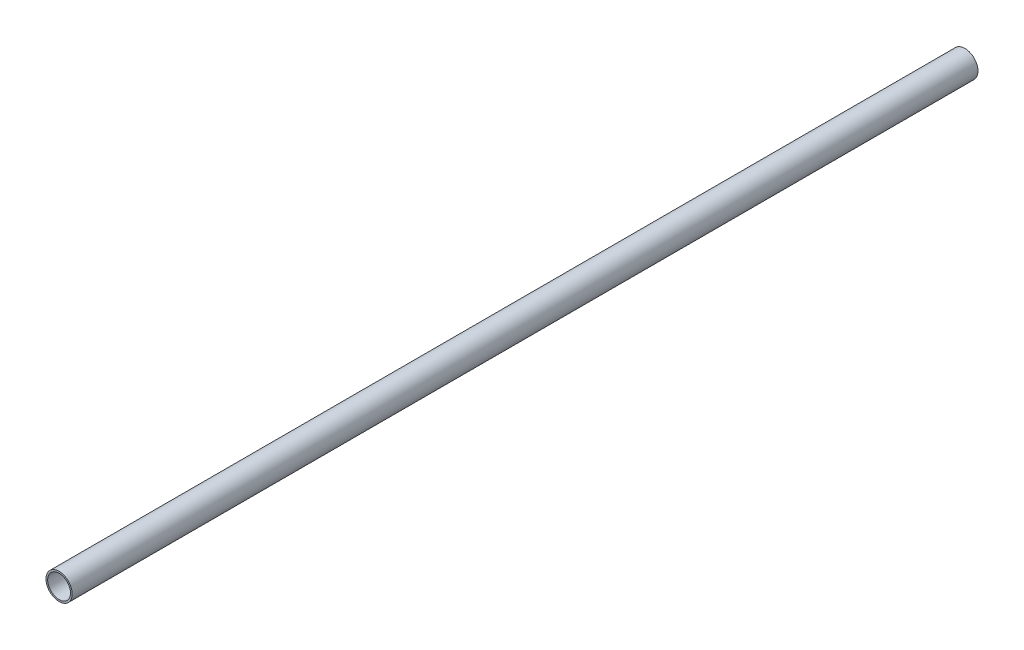
ISO-10303-21;
HEADER;
FILE_DESCRIPTION(('STEP AP214'),'2;1');
FILE_NAME('part.step','',(''),(''),'','','');
FILE_SCHEMA(('AUTOMOTIVE_DESIGN { 1 0 10303 214 1 1 1 1 }'));
ENDSEC;
DATA;
#1=APPLICATION_CONTEXT('core data for automotive mechanical design processes');
#2=APPLICATION_PROTOCOL_DEFINITION('international standard','automotive_design',2000,#1);
#3=PRODUCT_CONTEXT('',#1,'mechanical');
#4=PRODUCT('Part','Part','',(#3));
#5=PRODUCT_RELATED_PRODUCT_CATEGORY('part','',(#4));
#6=PRODUCT_DEFINITION_FORMATION('','',#4);
#7=PRODUCT_DEFINITION_CONTEXT('part definition',#1,'design');
#8=PRODUCT_DEFINITION('design','',#6,#7);
#9=PRODUCT_DEFINITION_SHAPE('','',#8);
#10=(LENGTH_UNIT() NAMED_UNIT(*) SI_UNIT(.MILLI.,.METRE.));
#11=(NAMED_UNIT(*) PLANE_ANGLE_UNIT() SI_UNIT($,.RADIAN.));
#12=(NAMED_UNIT(*) SI_UNIT($,.STERADIAN.) SOLID_ANGLE_UNIT());
#13=UNCERTAINTY_MEASURE_WITH_UNIT(LENGTH_MEASURE(1.E-05),#10,'distance_accuracy_value','');
#14=(GEOMETRIC_REPRESENTATION_CONTEXT(3) GLOBAL_UNCERTAINTY_ASSIGNED_CONTEXT((#13)) GLOBAL_UNIT_ASSIGNED_CONTEXT((#10,
#11,#12)) REPRESENTATION_CONTEXT('',''));
#15=CARTESIAN_POINT('',(0.,0.,0.));
#16=DIRECTION('',(0.,0.,1.));
#17=DIRECTION('',(1.,0.,0.));
#18=AXIS2_PLACEMENT_3D('',#15,#16,#17);
#19=CARTESIAN_POINT('',(-53.9999999999999,40.45,267.5));
#20=DIRECTION('',(0.,0.,-1.));
#21=DIRECTION('',(-1.,0.,0.));
#22=AXIS2_PLACEMENT_3D('',#19,#20,#21);
#23=CYLINDRICAL_SURFACE('',#22,7.75);
#24=CARTESIAN_POINT('',(-53.9999999999999,40.45,267.5));
#25=DIRECTION('',(0.,0.,1.));
#26=DIRECTION('',(1.,0.,0.));
#27=AXIS2_PLACEMENT_3D('',#24,#25,#26);
#28=CIRCLE('',#27,7.75);
#29=CARTESIAN_POINT('',(-46.2499999999999,40.45,267.5));
#30=VERTEX_POINT('',#29);
#31=EDGE_CURVE('E10',#30,#30,#28,.T.);
#32=ORIENTED_EDGE('',*,*,#31,.F.);
#33=EDGE_LOOP('',(#32));
#34=FACE_BOUND('',#33,.T.);
#35=CARTESIAN_POINT('',(-53.9999999999999,40.45,-267.5));
#36=DIRECTION('',(0.,0.,1.));
#37=DIRECTION('',(1.,0.,0.));
#38=AXIS2_PLACEMENT_3D('',#35,#36,#37);
#39=CIRCLE('',#38,7.75);
#40=CARTESIAN_POINT('',(-46.2499999999999,40.45,-267.5));
#41=VERTEX_POINT('',#40);
#42=EDGE_CURVE('E38',#41,#41,#39,.T.);
#43=ORIENTED_EDGE('',*,*,#42,.T.);
#44=EDGE_LOOP('',(#43));
#45=FACE_BOUND('',#44,.T.);
#46=ADVANCED_FACE('F31',(#34,#45),#23,.T.);
#47=CARTESIAN_POINT('',(-53.9999999999999,40.45,267.5));
#48=DIRECTION('',(0.,0.,1.));
#49=DIRECTION('',(1.,0.,0.));
#50=AXIS2_PLACEMENT_3D('',#47,#48,#49);
#51=PLANE('',#50);
#52=CARTESIAN_POINT('',(-53.9999999999999,40.45,267.5));
#53=DIRECTION('',(0.,0.,1.));
#54=DIRECTION('',(1.,0.,0.));
#55=AXIS2_PLACEMENT_3D('',#52,#53,#54);
#56=CIRCLE('',#55,6.75);
#57=CARTESIAN_POINT('',(-47.2499999999999,40.45,267.5));
#58=VERTEX_POINT('',#57);
#59=EDGE_CURVE('E43',#58,#58,#56,.T.);
#60=ORIENTED_EDGE('',*,*,#59,.F.);
#61=EDGE_LOOP('',(#60));
#62=FACE_BOUND('',#61,.T.);
#63=ORIENTED_EDGE('',*,*,#31,.T.);
#64=EDGE_LOOP('',(#63));
#65=FACE_BOUND('',#64,.T.);
#66=ADVANCED_FACE('F60',(#62,#65),#51,.T.);
#67=CARTESIAN_POINT('',(-53.9999999999999,40.45,-267.5));
#68=DIRECTION('',(0.,0.,1.));
#69=DIRECTION('',(1.,0.,0.));
#70=AXIS2_PLACEMENT_3D('',#67,#68,#69);
#71=PLANE('',#70);
#72=CARTESIAN_POINT('',(-53.9999999999999,40.45,-267.5));
#73=DIRECTION('',(0.,0.,1.));
#74=DIRECTION('',(1.,0.,0.));
#75=AXIS2_PLACEMENT_3D('',#72,#73,#74);
#76=CIRCLE('',#75,6.75);
#77=CARTESIAN_POINT('',(-47.2499999999999,40.45,-267.5));
#78=VERTEX_POINT('',#77);
#79=EDGE_CURVE('E34',#78,#78,#76,.T.);
#80=ORIENTED_EDGE('',*,*,#79,.T.);
#81=EDGE_LOOP('',(#80));
#82=FACE_BOUND('',#81,.T.);
#83=ORIENTED_EDGE('',*,*,#42,.F.);
#84=EDGE_LOOP('',(#83));
#85=FACE_BOUND('',#84,.T.);
#86=ADVANCED_FACE('F51',(#82,#85),#71,.F.);
#87=CARTESIAN_POINT('',(-53.9999999999999,40.45,-284.7));
#88=DIRECTION('',(0.,0.,1.));
#89=DIRECTION('',(1.,0.,0.));
#90=AXIS2_PLACEMENT_3D('',#87,#88,#89);
#91=CYLINDRICAL_SURFACE('',#90,6.75);
#92=ORIENTED_EDGE('',*,*,#59,.T.);
#93=EDGE_LOOP('',(#92));
#94=FACE_BOUND('',#93,.T.);
#95=ORIENTED_EDGE('',*,*,#79,.F.);
#96=EDGE_LOOP('',(#95));
#97=FACE_BOUND('',#96,.T.);
#98=ADVANCED_FACE('F54',(#94,#97),#91,.F.);
#99=CLOSED_SHELL('',(#46,#66,#86,#98));
#100=MANIFOLD_SOLID_BREP('B2',#99);
#101=ADVANCED_BREP_SHAPE_REPRESENTATION('',(#18,#100),#14);
#102=SHAPE_DEFINITION_REPRESENTATION(#9,#101);
ENDSEC;
END-ISO-10303-21;
